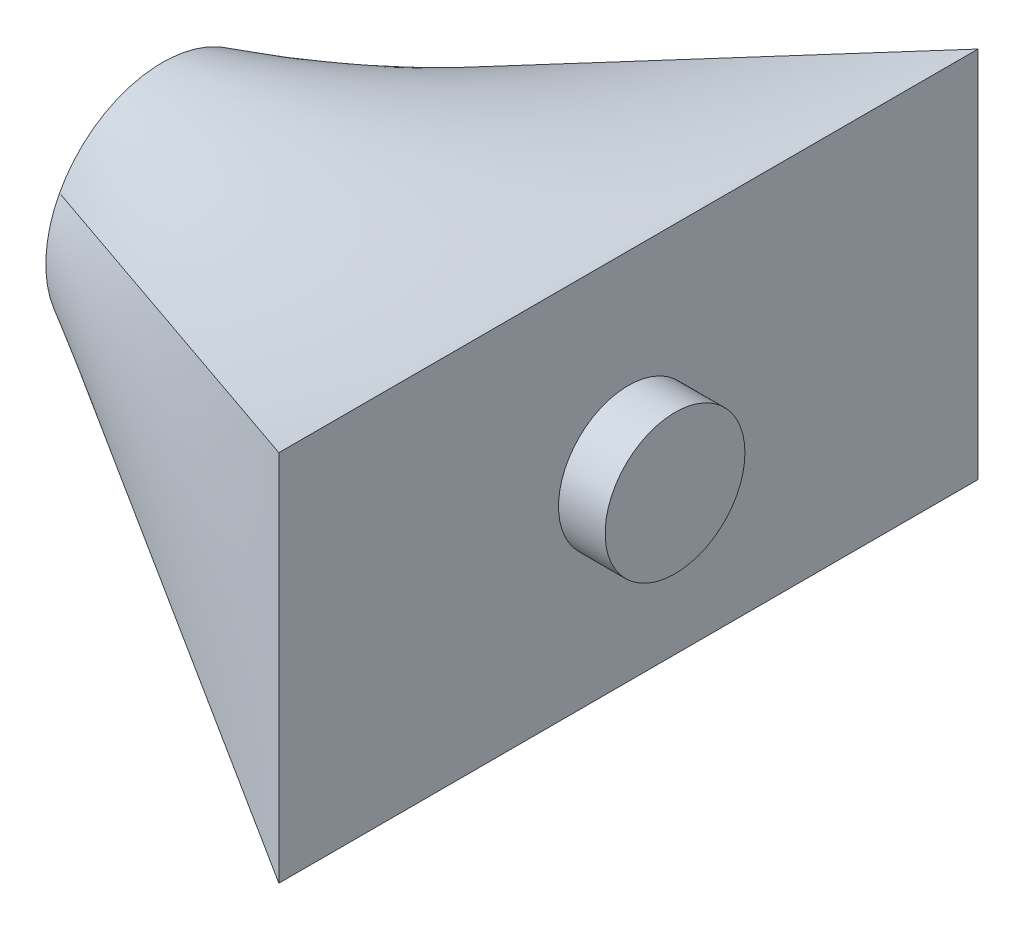
ISO-10303-21;
HEADER;
FILE_DESCRIPTION(('STEP AP214'),'2;1');
FILE_NAME('part.step','',(''),(''),'','','');
FILE_SCHEMA(('AUTOMOTIVE_DESIGN { 1 0 10303 214 1 1 1 1 }'));
ENDSEC;
DATA;
#1=APPLICATION_CONTEXT('core data for automotive mechanical design processes');
#2=APPLICATION_PROTOCOL_DEFINITION('international standard','automotive_design',2000,#1);
#3=PRODUCT_CONTEXT('',#1,'mechanical');
#4=PRODUCT('Part','Part','',(#3));
#5=PRODUCT_RELATED_PRODUCT_CATEGORY('part','',(#4));
#6=PRODUCT_DEFINITION_FORMATION('','',#4);
#7=PRODUCT_DEFINITION_CONTEXT('part definition',#1,'design');
#8=PRODUCT_DEFINITION('design','',#6,#7);
#9=PRODUCT_DEFINITION_SHAPE('','',#8);
#10=(LENGTH_UNIT() NAMED_UNIT(*) SI_UNIT(.MILLI.,.METRE.));
#11=(NAMED_UNIT(*) PLANE_ANGLE_UNIT() SI_UNIT($,.RADIAN.));
#12=(NAMED_UNIT(*) SI_UNIT($,.STERADIAN.) SOLID_ANGLE_UNIT());
#13=UNCERTAINTY_MEASURE_WITH_UNIT(LENGTH_MEASURE(1.E-05),#10,'distance_accuracy_value','');
#14=(GEOMETRIC_REPRESENTATION_CONTEXT(3) GLOBAL_UNCERTAINTY_ASSIGNED_CONTEXT((#13)) GLOBAL_UNIT_ASSIGNED_CONTEXT((#10,
#11,#12)) REPRESENTATION_CONTEXT('',''));
#15=CARTESIAN_POINT('',(0.,0.,0.));
#16=DIRECTION('',(0.,0.,1.));
#17=DIRECTION('',(1.,0.,0.));
#18=AXIS2_PLACEMENT_3D('',#15,#16,#17);
#19=CARTESIAN_POINT('',(0.,0.,0.));
#20=DIRECTION('',(1.,0.,0.));
#21=DIRECTION('',(0.,0.,-1.));
#22=AXIS2_PLACEMENT_3D('',#19,#20,#21);
#23=PLANE('',#22);
#24=CARTESIAN_POINT('',(0.,0.,0.));
#25=DIRECTION('',(1.,0.,0.));
#26=DIRECTION('',(0.,0.,-1.));
#27=AXIS2_PLACEMENT_3D('',#24,#25,#26);
#28=CIRCLE('',#27,25.);
#29=CARTESIAN_POINT('',(0.,-11.7647058823529,22.0588235294118));
#30=VERTEX_POINT('',#29);
#31=CARTESIAN_POINT('',(0.,-11.7647058823529,-22.0588235294118));
#32=VERTEX_POINT('',#31);
#33=EDGE_CURVE('E80',#30,#32,#28,.T.);
#34=ORIENTED_EDGE('',*,*,#33,.F.);
#35=CARTESIAN_POINT('',(0.,11.7647058823529,22.0588235294118));
#36=VERTEX_POINT('',#35);
#37=EDGE_CURVE('E145',#36,#30,#28,.T.);
#38=ORIENTED_EDGE('',*,*,#37,.F.);
#39=CARTESIAN_POINT('',(0.,11.7647058823529,-22.0588235294118));
#40=VERTEX_POINT('',#39);
#41=EDGE_CURVE('E151',#40,#36,#28,.T.);
#42=ORIENTED_EDGE('',*,*,#41,.F.);
#43=EDGE_CURVE('E211',#32,#40,#28,.T.);
#44=ORIENTED_EDGE('',*,*,#43,.F.);
#45=EDGE_LOOP('',(#34,#38,#42,#44));
#46=FACE_BOUND('',#45,.T.);
#47=ADVANCED_FACE('F69',(#46),#23,.F.);
#48=CARTESIAN_POINT('',(100.,0.,0.));
#49=DIRECTION('',(1.,0.,0.));
#50=DIRECTION('',(0.,0.,-1.));
#51=AXIS2_PLACEMENT_3D('',#48,#49,#50);
#52=PLANE('',#51);
#53=CARTESIAN_POINT('',(100.,0.,0.));
#54=DIRECTION('',(1.,0.,0.));
#55=DIRECTION('',(0.,0.,-1.));
#56=AXIS2_PLACEMENT_3D('',#53,#54,#55);
#57=CIRCLE('',#56,15.);
#58=CARTESIAN_POINT('',(100.,0.,-15.));
#59=VERTEX_POINT('',#58);
#60=EDGE_CURVE('E12',#59,#59,#57,.T.);
#61=ORIENTED_EDGE('',*,*,#60,.F.);
#62=EDGE_LOOP('',(#61));
#63=FACE_BOUND('',#62,.T.);
#64=DIRECTION('',(0.,1.,0.));
#65=VECTOR('',#64,1.);
#66=CARTESIAN_POINT('',(100.,40.,-75.));
#67=LINE('',#66,#65);
#68=CARTESIAN_POINT('',(100.,-40.,-75.));
#69=VERTEX_POINT('',#68);
#70=CARTESIAN_POINT('',(100.,40.,-75.));
#71=VERTEX_POINT('',#70);
#72=EDGE_CURVE('E140',#69,#71,#67,.T.);
#73=ORIENTED_EDGE('',*,*,#72,.T.);
#74=DIRECTION('',(0.,0.,1.));
#75=VECTOR('',#74,1.);
#76=CARTESIAN_POINT('',(100.,40.,75.));
#77=LINE('',#76,#75);
#78=CARTESIAN_POINT('',(100.,40.,75.));
#79=VERTEX_POINT('',#78);
#80=EDGE_CURVE('E123',#71,#79,#77,.T.);
#81=ORIENTED_EDGE('',*,*,#80,.T.);
#82=DIRECTION('',(0.,-1.,0.));
#83=VECTOR('',#82,1.);
#84=CARTESIAN_POINT('',(100.,40.,75.));
#85=LINE('',#84,#83);
#86=CARTESIAN_POINT('',(100.,-40.,75.));
#87=VERTEX_POINT('',#86);
#88=EDGE_CURVE('E115',#79,#87,#85,.T.);
#89=ORIENTED_EDGE('',*,*,#88,.T.);
#90=DIRECTION('',(0.,0.,-1.));
#91=VECTOR('',#90,1.);
#92=CARTESIAN_POINT('',(100.,-40.,75.));
#93=LINE('',#92,#91);
#94=EDGE_CURVE('E120',#87,#69,#93,.T.);
#95=ORIENTED_EDGE('',*,*,#94,.T.);
#96=EDGE_LOOP('',(#73,#81,#89,#95));
#97=FACE_BOUND('',#96,.T.);
#98=ADVANCED_FACE('F119',(#63,#97),#52,.T.);
#99=CARTESIAN_POINT('',(100.,40.,75.));
#100=CARTESIAN_POINT('',(0.,11.7647058823529,22.0588235294118));
#101=CARTESIAN_POINT('',(100.,40.,68.75));
#102=CARTESIAN_POINT('',(0.,13.386678200692,21.1937716262976));
#103=CARTESIAN_POINT('',(100.,40.,62.5));
#104=CARTESIAN_POINT('',(0.,15.0240317080234,20.0898163476126));
#105=CARTESIAN_POINT('',(100.,40.,53.125));
#106=CARTESIAN_POINT('',(0.,17.3580465160507,18.0216198927218));
#107=CARTESIAN_POINT('',(100.,40.,50.));
#108=CARTESIAN_POINT('',(0.,18.1150309626572,17.2640270219553));
#109=CARTESIAN_POINT('',(100.,40.,43.75));
#110=CARTESIAN_POINT('',(0.,19.5562019140552,15.6126853068118));
#111=CARTESIAN_POINT('',(100.,40.,40.625));
#112=CARTESIAN_POINT('',(0.,20.2402996380776,14.718878882249));
#113=CARTESIAN_POINT('',(100.,40.,34.375));
#114=CARTESIAN_POINT('',(0.,21.5028196279774,12.8040568975675));
#115=CARTESIAN_POINT('',(100.,40.,31.25));
#116=CARTESIAN_POINT('',(0.,22.0811225719373,11.7830205739268));
#117=CARTESIAN_POINT('',(100.,40.,25.));
#118=CARTESIAN_POINT('',(0.,23.100317047337,9.6328033404099));
#119=CARTESIAN_POINT('',(100.,40.,21.875));
#120=CARTESIAN_POINT('',(0.,23.5410775880106,8.50365552573215));
#121=CARTESIAN_POINT('',(100.,40.,15.625));
#122=CARTESIAN_POINT('',(0.,24.2584334144344,6.1662711246346));
#123=CARTESIAN_POINT('',(100.,40.,12.5));
#124=CARTESIAN_POINT('',(0.,24.5349148918007,4.95812669643758));
#125=CARTESIAN_POINT('',(100.,40.,6.24999999999999));
#126=CARTESIAN_POINT('',(0.,24.9057314724006,2.49992178087753));
#127=CARTESIAN_POINT('',(100.,40.,3.12499999999998));
#128=CARTESIAN_POINT('',(0.,25.,1.25));
#129=CARTESIAN_POINT('',(100.,40.,-3.12500000000002));
#130=CARTESIAN_POINT('',(0.,25.,-1.25));
#131=CARTESIAN_POINT('',(100.,40.,-6.25000000000001));
#132=CARTESIAN_POINT('',(0.,24.9057314724006,-2.49992178087753));
#133=CARTESIAN_POINT('',(100.,40.,-12.5));
#134=CARTESIAN_POINT('',(0.,24.5349148918007,-4.95812669643757));
#135=CARTESIAN_POINT('',(100.,40.,-15.625));
#136=CARTESIAN_POINT('',(0.,24.2584334144344,-6.16627112463459));
#137=CARTESIAN_POINT('',(100.,40.,-21.875));
#138=CARTESIAN_POINT('',(0.,23.5410775880106,-8.50365552573214));
#139=CARTESIAN_POINT('',(100.,40.,-25.));
#140=CARTESIAN_POINT('',(0.,23.100317047337,-9.63280334040989));
#141=CARTESIAN_POINT('',(100.,40.,-31.25));
#142=CARTESIAN_POINT('',(0.,22.0811225719373,-11.7830205739268));
#143=CARTESIAN_POINT('',(100.,40.,-34.375));
#144=CARTESIAN_POINT('',(0.,21.5028196279774,-12.8040568975675));
#145=CARTESIAN_POINT('',(100.,40.,-40.625));
#146=CARTESIAN_POINT('',(0.,20.2402996380776,-14.718878882249));
#147=CARTESIAN_POINT('',(100.,40.,-43.75));
#148=CARTESIAN_POINT('',(0.,19.5562019140552,-15.6126853068118));
#149=CARTESIAN_POINT('',(100.,40.,-50.));
#150=CARTESIAN_POINT('',(0.,18.1150309626572,-17.2640270219553));
#151=CARTESIAN_POINT('',(100.,40.,-53.125));
#152=CARTESIAN_POINT('',(0.,17.3580465160507,-18.0216198927218));
#153=CARTESIAN_POINT('',(100.,40.,-62.5));
#154=CARTESIAN_POINT('',(0.,15.0240317080234,-20.0898163476126));
#155=CARTESIAN_POINT('',(100.,40.,-68.75));
#156=CARTESIAN_POINT('',(0.,13.386678200692,-21.1937716262976));
#157=CARTESIAN_POINT('',(100.,40.,-75.));
#158=CARTESIAN_POINT('',(0.,11.7647058823529,-22.0588235294118));
#159=B_SPLINE_SURFACE_WITH_KNOTS('',3,1,((#99,#100),(#101,#102),(#103,#104),(#105,#106),(#107,
#108),(#109,#110),(#111,#112),(#113,#114),(#115,#116),(#117,#118),(#119,#120),(#121,#122),(#123,
#124),(#125,#126),(#127,#128),(#129,#130),(#131,#132),(#133,#134),(#135,#136),(#137,#138),(#139,
#140),(#141,#142),(#143,#144),(#145,#146),(#147,#148),(#149,#150),(#151,#152),(#153,#154),(#155,
#156),(#157,#158)),.UNSPECIFIED.,.F.,.F.,.F.,(4,2,2,2,2,2,2,2,2,2,2,2,2,2,4),(2,2),(0.,0.125,
0.1875,0.25,0.3125,0.375,0.4375,0.5,0.5625,0.625,0.6875,0.75,0.8125,0.875,1.),(0.,1.),.UNSPECIFIED.);
#160=DIRECTION('',(-0.857492925712544,-0.242115649612954,0.453966843024288));
#161=VECTOR('',#160,1.);
#162=CARTESIAN_POINT('',(50.,25.8823529411765,-48.5294117647059));
#163=LINE('',#162,#161);
#164=EDGE_CURVE('E153',#71,#40,#163,.T.);
#165=DIRECTION('',(0.857492925712544,0.242115649612954,0.453966843024288));
#166=VECTOR('',#165,1.);
#167=CARTESIAN_POINT('',(50.,25.8823529411765,48.5294117647059));
#168=LINE('',#167,#166);
#169=EDGE_CURVE('E269',#36,#79,#168,.T.);
#170=ORIENTED_EDGE('',*,*,#80,.F.);
#171=ORIENTED_EDGE('',*,*,#164,.T.);
#172=ORIENTED_EDGE('',*,*,#41,.T.);
#173=ORIENTED_EDGE('',*,*,#169,.T.);
#174=EDGE_LOOP('',(#170,#171,#172,#173));
#175=FACE_BOUND('',#174,.T.);
#176=ADVANCED_FACE('F231',(#175),#159,.T.);
#177=CARTESIAN_POINT('',(100.,40.,-75.));
#178=CARTESIAN_POINT('',(0.,11.7647058823529,-22.0588235294118));
#179=CARTESIAN_POINT('',(100.,33.3333333333333,-75.));
#180=CARTESIAN_POINT('',(0.,10.0346020761246,-22.9815455594002));
#181=CARTESIAN_POINT('',(100.,26.6666666666667,-75.));
#182=CARTESIAN_POINT('',(0.,8.14201183431953,-23.7258382642998));
#183=CARTESIAN_POINT('',(100.,13.3333333333334,-75.));
#184=CARTESIAN_POINT('',(0.,4.16568047337278,-24.7357001972387));
#185=CARTESIAN_POINT('',(100.,6.6666666666667,-75.));
#186=CARTESIAN_POINT('',(0.,2.08333333333333,-25.));
#187=CARTESIAN_POINT('',(100.,-6.66666666666663,-75.));
#188=CARTESIAN_POINT('',(0.,-2.08333333333334,-25.));
#189=CARTESIAN_POINT('',(100.,-13.3333333333333,-75.));
#190=CARTESIAN_POINT('',(0.,-4.16568047337279,-24.7357001972387));
#191=CARTESIAN_POINT('',(100.,-26.6666666666666,-75.));
#192=CARTESIAN_POINT('',(0.,-8.14201183431954,-23.7258382642998));
#193=CARTESIAN_POINT('',(100.,-33.3333333333333,-75.));
#194=CARTESIAN_POINT('',(0.,-10.0346020761246,-22.9815455594002));
#195=CARTESIAN_POINT('',(100.,-40.,-75.));
#196=CARTESIAN_POINT('',(0.,-11.7647058823529,-22.0588235294118));
#197=B_SPLINE_SURFACE_WITH_KNOTS('',3,1,((#177,#178),(#179,#180),(#181,#182),(#183,#184),(#185,
#186),(#187,#188),(#189,#190),(#191,#192),(#193,#194),(#195,#196)),.UNSPECIFIED.,.F.,.F.,.F.,(4,
2,2,2,4),(2,2),(0.,0.25,0.5,0.75,1.),(0.,1.),.UNSPECIFIED.);
#198=DIRECTION('',(-0.857492925712544,0.242115649612954,0.453966843024288));
#199=VECTOR('',#198,1.);
#200=CARTESIAN_POINT('',(50.,-25.8823529411765,-48.5294117647059));
#201=LINE('',#200,#199);
#202=EDGE_CURVE('E88',#69,#32,#201,.T.);
#203=ORIENTED_EDGE('',*,*,#72,.F.);
#204=ORIENTED_EDGE('',*,*,#202,.T.);
#205=ORIENTED_EDGE('',*,*,#43,.T.);
#206=ORIENTED_EDGE('',*,*,#164,.F.);
#207=EDGE_LOOP('',(#203,#204,#205,#206));
#208=FACE_BOUND('',#207,.T.);
#209=ADVANCED_FACE('F175',(#208),#197,.T.);
#210=CARTESIAN_POINT('',(100.,-40.,75.));
#211=CARTESIAN_POINT('',(0.,-11.7647058823529,22.0588235294118));
#212=CARTESIAN_POINT('',(100.,-33.3333333333333,75.));
#213=CARTESIAN_POINT('',(0.,-10.0346020761246,22.9815455594002));
#214=CARTESIAN_POINT('',(100.,-26.6666666666667,75.));
#215=CARTESIAN_POINT('',(0.,-8.14201183431952,23.7258382642998));
#216=CARTESIAN_POINT('',(100.,-13.3333333333333,75.));
#217=CARTESIAN_POINT('',(0.,-4.16568047337277,24.7357001972386));
#218=CARTESIAN_POINT('',(100.,-6.66666666666668,75.));
#219=CARTESIAN_POINT('',(0.,-2.08333333333333,25.));
#220=CARTESIAN_POINT('',(100.,6.66666666666665,75.));
#221=CARTESIAN_POINT('',(0.,2.08333333333333,25.));
#222=CARTESIAN_POINT('',(100.,13.3333333333333,75.));
#223=CARTESIAN_POINT('',(0.,4.16568047337278,24.7357001972387));
#224=CARTESIAN_POINT('',(100.,26.6666666666667,75.));
#225=CARTESIAN_POINT('',(0.,8.14201183431952,23.7258382642998));
#226=CARTESIAN_POINT('',(100.,33.3333333333333,75.));
#227=CARTESIAN_POINT('',(0.,10.0346020761246,22.9815455594002));
#228=CARTESIAN_POINT('',(100.,40.,75.));
#229=CARTESIAN_POINT('',(0.,11.7647058823529,22.0588235294118));
#230=B_SPLINE_SURFACE_WITH_KNOTS('',3,1,((#210,#211),(#212,#213),(#214,#215),(#216,#217),(#218,
#219),(#220,#221),(#222,#223),(#224,#225),(#226,#227),(#228,#229)),.UNSPECIFIED.,.F.,.F.,.F.,(4,
2,2,2,4),(2,2),(0.,0.25,0.5,0.75,1.),(0.,1.),.UNSPECIFIED.);
#231=DIRECTION('',(-0.857492925712544,0.242115649612954,-0.453966843024288));
#232=VECTOR('',#231,1.);
#233=CARTESIAN_POINT('',(50.,-25.8823529411765,48.5294117647059));
#234=LINE('',#233,#232);
#235=EDGE_CURVE('E138',#87,#30,#234,.T.);
#236=ORIENTED_EDGE('',*,*,#88,.F.);
#237=ORIENTED_EDGE('',*,*,#169,.F.);
#238=ORIENTED_EDGE('',*,*,#37,.T.);
#239=ORIENTED_EDGE('',*,*,#235,.F.);
#240=EDGE_LOOP('',(#236,#237,#238,#239));
#241=FACE_BOUND('',#240,.T.);
#242=ADVANCED_FACE('F144',(#241),#230,.T.);
#243=CARTESIAN_POINT('',(100.,-40.,-75.));
#244=CARTESIAN_POINT('',(0.,-11.7647058823529,-22.0588235294118));
#245=CARTESIAN_POINT('',(100.,-40.,-68.75));
#246=CARTESIAN_POINT('',(0.,-13.386678200692,-21.1937716262976));
#247=CARTESIAN_POINT('',(100.,-40.,-62.4999999999999));
#248=CARTESIAN_POINT('',(0.,-15.0240317080234,-20.0898163476126));
#249=CARTESIAN_POINT('',(100.,-40.,-53.1249999999999));
#250=CARTESIAN_POINT('',(0.,-17.3580465160507,-18.0216198927218));
#251=CARTESIAN_POINT('',(100.,-40.,-49.9999999999999));
#252=CARTESIAN_POINT('',(0.,-18.1150309626572,-17.2640270219553));
#253=CARTESIAN_POINT('',(100.,-40.,-43.7499999999999));
#254=CARTESIAN_POINT('',(0.,-19.5562019140552,-15.6126853068118));
#255=CARTESIAN_POINT('',(100.,-40.,-40.6249999999998));
#256=CARTESIAN_POINT('',(0.,-20.2402996380776,-14.718878882249));
#257=CARTESIAN_POINT('',(100.,-40.,-34.3749999999998));
#258=CARTESIAN_POINT('',(0.,-21.5028196279774,-12.8040568975675));
#259=CARTESIAN_POINT('',(100.,-40.,-31.2499999999998));
#260=CARTESIAN_POINT('',(0.,-22.0811225719373,-11.7830205739268));
#261=CARTESIAN_POINT('',(100.,-40.,-24.9999999999998));
#262=CARTESIAN_POINT('',(0.,-23.100317047337,-9.63280334040989));
#263=CARTESIAN_POINT('',(100.,-40.,-21.8749999999998));
#264=CARTESIAN_POINT('',(0.,-23.5410775880106,-8.50365552573215));
#265=CARTESIAN_POINT('',(100.,-40.,-15.6249999999998));
#266=CARTESIAN_POINT('',(0.,-24.2584334144344,-6.16627112463459));
#267=CARTESIAN_POINT('',(100.,-40.,-12.4999999999998));
#268=CARTESIAN_POINT('',(0.,-24.5349148918007,-4.95812669643756));
#269=CARTESIAN_POINT('',(100.,-40.,-6.24999999999984));
#270=CARTESIAN_POINT('',(0.,-24.9057314724006,-2.49992178087752));
#271=CARTESIAN_POINT('',(100.,-40.,-3.12499999999985));
#272=CARTESIAN_POINT('',(0.,-25.,-1.24999999999999));
#273=CARTESIAN_POINT('',(100.,-40.,3.12500000000014));
#274=CARTESIAN_POINT('',(0.,-25.,1.25000000000001));
#275=CARTESIAN_POINT('',(100.,-40.,6.25000000000015));
#276=CARTESIAN_POINT('',(0.,-24.9057314724006,2.49992178087754));
#277=CARTESIAN_POINT('',(100.,-40.,12.5000000000002));
#278=CARTESIAN_POINT('',(0.,-24.5349148918007,4.95812669643758));
#279=CARTESIAN_POINT('',(100.,-40.,15.6250000000001));
#280=CARTESIAN_POINT('',(0.,-24.2584334144344,6.1662711246346));
#281=CARTESIAN_POINT('',(100.,-40.,21.8750000000001));
#282=CARTESIAN_POINT('',(0.,-23.5410775880106,8.50365552573216));
#283=CARTESIAN_POINT('',(100.,-40.,25.0000000000001));
#284=CARTESIAN_POINT('',(0.,-23.100317047337,9.63280334040991));
#285=CARTESIAN_POINT('',(100.,-40.,31.2500000000001));
#286=CARTESIAN_POINT('',(0.,-22.0811225719372,11.7830205739268));
#287=CARTESIAN_POINT('',(100.,-40.,34.3750000000001));
#288=CARTESIAN_POINT('',(0.,-21.5028196279774,12.8040568975675));
#289=CARTESIAN_POINT('',(100.,-40.,40.6250000000001));
#290=CARTESIAN_POINT('',(0.,-20.2402996380776,14.718878882249));
#291=CARTESIAN_POINT('',(100.,-40.,43.7500000000001));
#292=CARTESIAN_POINT('',(0.,-19.5562019140552,15.6126853068118));
#293=CARTESIAN_POINT('',(100.,-40.,50.));
#294=CARTESIAN_POINT('',(0.,-18.1150309626571,17.2640270219553));
#295=CARTESIAN_POINT('',(100.,-40.,53.125));
#296=CARTESIAN_POINT('',(0.,-17.3580465160507,18.0216198927218));
#297=CARTESIAN_POINT('',(100.,-40.,62.5));
#298=CARTESIAN_POINT('',(0.,-15.0240317080234,20.0898163476126));
#299=CARTESIAN_POINT('',(100.,-40.,68.75));
#300=CARTESIAN_POINT('',(0.,-13.386678200692,21.1937716262976));
#301=CARTESIAN_POINT('',(100.,-40.,75.));
#302=CARTESIAN_POINT('',(0.,-11.7647058823529,22.0588235294118));
#303=B_SPLINE_SURFACE_WITH_KNOTS('',3,1,((#243,#244),(#245,#246),(#247,#248),(#249,#250),(#251,
#252),(#253,#254),(#255,#256),(#257,#258),(#259,#260),(#261,#262),(#263,#264),(#265,#266),(#267,
#268),(#269,#270),(#271,#272),(#273,#274),(#275,#276),(#277,#278),(#279,#280),(#281,#282),(#283,
#284),(#285,#286),(#287,#288),(#289,#290),(#291,#292),(#293,#294),(#295,#296),(#297,#298),(#299,
#300),(#301,#302)),.UNSPECIFIED.,.F.,.F.,.F.,(4,2,2,2,2,2,2,2,2,2,2,2,2,2,4),(2,2),(0.,0.125,
0.1875,0.25,0.3125,0.375,0.4375,0.5,0.5625,0.625,0.6875,0.75,0.8125,0.875,1.),(0.,1.),.UNSPECIFIED.);
#304=ORIENTED_EDGE('',*,*,#94,.F.);
#305=ORIENTED_EDGE('',*,*,#235,.T.);
#306=ORIENTED_EDGE('',*,*,#33,.T.);
#307=ORIENTED_EDGE('',*,*,#202,.F.);
#308=EDGE_LOOP('',(#304,#305,#306,#307));
#309=FACE_BOUND('',#308,.T.);
#310=ADVANCED_FACE('F137',(#309),#303,.T.);
#311=CARTESIAN_POINT('',(110.,0.,0.));
#312=DIRECTION('',(-1.,0.,0.));
#313=DIRECTION('',(0.,0.,1.));
#314=AXIS2_PLACEMENT_3D('',#311,#312,#313);
#315=CYLINDRICAL_SURFACE('',#314,15.);
#316=CARTESIAN_POINT('',(110.,0.,0.));
#317=DIRECTION('',(1.,0.,0.));
#318=DIRECTION('',(0.,0.,-1.));
#319=AXIS2_PLACEMENT_3D('',#316,#317,#318);
#320=CIRCLE('',#319,15.);
#321=CARTESIAN_POINT('',(110.,0.,-15.));
#322=VERTEX_POINT('',#321);
#323=EDGE_CURVE('E294',#322,#322,#320,.T.);
#324=ORIENTED_EDGE('',*,*,#323,.F.);
#325=EDGE_LOOP('',(#324));
#326=FACE_BOUND('',#325,.T.);
#327=ORIENTED_EDGE('',*,*,#60,.T.);
#328=EDGE_LOOP('',(#327));
#329=FACE_BOUND('',#328,.T.);
#330=ADVANCED_FACE('F241',(#326,#329),#315,.T.);
#331=CARTESIAN_POINT('',(110.,0.,0.));
#332=DIRECTION('',(1.,0.,0.));
#333=DIRECTION('',(0.,0.,-1.));
#334=AXIS2_PLACEMENT_3D('',#331,#332,#333);
#335=PLANE('',#334);
#336=ORIENTED_EDGE('',*,*,#323,.T.);
#337=EDGE_LOOP('',(#336));
#338=FACE_BOUND('',#337,.T.);
#339=ADVANCED_FACE('F326',(#338),#335,.T.);
#340=CLOSED_SHELL('',(#47,#98,#176,#209,#242,#310,#330,#339));
#341=MANIFOLD_SOLID_BREP('B2',#340);
#342=ADVANCED_BREP_SHAPE_REPRESENTATION('',(#18,#341),#14);
#343=SHAPE_DEFINITION_REPRESENTATION(#9,#342);
ENDSEC;
END-ISO-10303-21;
